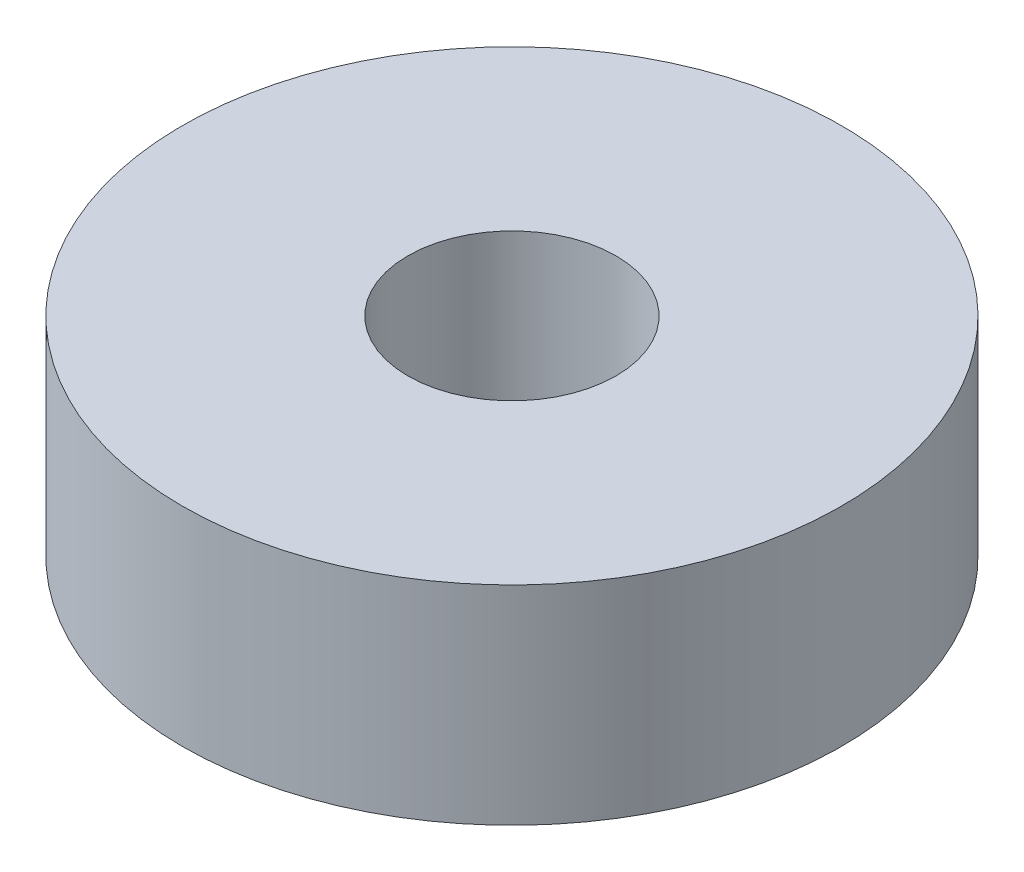
ISO-10303-21;
HEADER;
FILE_DESCRIPTION(('STEP AP214'),'2;1');
FILE_NAME('part.step','',(''),(''),'','','');
FILE_SCHEMA(('AUTOMOTIVE_DESIGN { 1 0 10303 214 1 1 1 1 }'));
ENDSEC;
DATA;
#1=APPLICATION_CONTEXT('core data for automotive mechanical design processes');
#2=APPLICATION_PROTOCOL_DEFINITION('international standard','automotive_design',2000,#1);
#3=PRODUCT_CONTEXT('',#1,'mechanical');
#4=PRODUCT('Part','Part','',(#3));
#5=PRODUCT_RELATED_PRODUCT_CATEGORY('part','',(#4));
#6=PRODUCT_DEFINITION_FORMATION('','',#4);
#7=PRODUCT_DEFINITION_CONTEXT('part definition',#1,'design');
#8=PRODUCT_DEFINITION('design','',#6,#7);
#9=PRODUCT_DEFINITION_SHAPE('','',#8);
#10=(LENGTH_UNIT() NAMED_UNIT(*) SI_UNIT(.MILLI.,.METRE.));
#11=(NAMED_UNIT(*) PLANE_ANGLE_UNIT() SI_UNIT($,.RADIAN.));
#12=(NAMED_UNIT(*) SI_UNIT($,.STERADIAN.) SOLID_ANGLE_UNIT());
#13=UNCERTAINTY_MEASURE_WITH_UNIT(LENGTH_MEASURE(1.E-05),#10,'distance_accuracy_value','');
#14=(GEOMETRIC_REPRESENTATION_CONTEXT(3) GLOBAL_UNCERTAINTY_ASSIGNED_CONTEXT((#13)) GLOBAL_UNIT_ASSIGNED_CONTEXT((#10,
#11,#12)) REPRESENTATION_CONTEXT('',''));
#15=CARTESIAN_POINT('',(0.,0.,0.));
#16=DIRECTION('',(0.,0.,1.));
#17=DIRECTION('',(1.,0.,0.));
#18=AXIS2_PLACEMENT_3D('',#15,#16,#17);
#19=CARTESIAN_POINT('',(0.,6.,0.));
#20=DIRECTION('',(0.,1.,0.));
#21=DIRECTION('',(0.,0.,1.));
#22=AXIS2_PLACEMENT_3D('',#19,#20,#21);
#23=PLANE('',#22);
#24=CARTESIAN_POINT('',(0.,6.,0.));
#25=DIRECTION('',(0.,1.,0.));
#26=DIRECTION('',(0.,0.,1.));
#27=AXIS2_PLACEMENT_3D('',#24,#25,#26);
#28=CIRCLE('',#27,9.5);
#29=CARTESIAN_POINT('',(0.,6.,9.5));
#30=VERTEX_POINT('',#29);
#31=EDGE_CURVE('E10',#30,#30,#28,.T.);
#32=ORIENTED_EDGE('',*,*,#31,.T.);
#33=EDGE_LOOP('',(#32));
#34=FACE_BOUND('',#33,.T.);
#35=CARTESIAN_POINT('',(0.,6.,0.));
#36=DIRECTION('',(0.,1.,0.));
#37=DIRECTION('',(0.,0.,1.));
#38=AXIS2_PLACEMENT_3D('',#35,#36,#37);
#39=CIRCLE('',#38,3.);
#40=CARTESIAN_POINT('',(0.,6.,3.));
#41=VERTEX_POINT('',#40);
#42=EDGE_CURVE('E45',#41,#41,#39,.T.);
#43=ORIENTED_EDGE('',*,*,#42,.F.);
#44=EDGE_LOOP('',(#43));
#45=FACE_BOUND('',#44,.T.);
#46=ADVANCED_FACE('F34',(#34,#45),#23,.T.);
#47=CARTESIAN_POINT('',(0.,0.,0.));
#48=DIRECTION('',(0.,1.,0.));
#49=DIRECTION('',(0.,0.,1.));
#50=AXIS2_PLACEMENT_3D('',#47,#48,#49);
#51=PLANE('',#50);
#52=CARTESIAN_POINT('',(0.,0.,0.));
#53=DIRECTION('',(0.,1.,0.));
#54=DIRECTION('',(0.,0.,1.));
#55=AXIS2_PLACEMENT_3D('',#52,#53,#54);
#56=CIRCLE('',#55,9.5);
#57=CARTESIAN_POINT('',(0.,0.,9.5));
#58=VERTEX_POINT('',#57);
#59=EDGE_CURVE('E38',#58,#58,#56,.T.);
#60=ORIENTED_EDGE('',*,*,#59,.F.);
#61=EDGE_LOOP('',(#60));
#62=FACE_BOUND('',#61,.T.);
#63=CARTESIAN_POINT('',(0.,0.,0.));
#64=DIRECTION('',(0.,1.,0.));
#65=DIRECTION('',(0.,0.,1.));
#66=AXIS2_PLACEMENT_3D('',#63,#64,#65);
#67=CIRCLE('',#66,3.);
#68=CARTESIAN_POINT('',(0.,0.,3.));
#69=VERTEX_POINT('',#68);
#70=EDGE_CURVE('E47',#69,#69,#67,.T.);
#71=ORIENTED_EDGE('',*,*,#70,.T.);
#72=EDGE_LOOP('',(#71));
#73=FACE_BOUND('',#72,.T.);
#74=ADVANCED_FACE('F57',(#62,#73),#51,.F.);
#75=CARTESIAN_POINT('',(0.,6.,0.));
#76=DIRECTION('',(0.,-1.,0.));
#77=DIRECTION('',(0.,0.,-1.));
#78=AXIS2_PLACEMENT_3D('',#75,#76,#77);
#79=CYLINDRICAL_SURFACE('',#78,9.5);
#80=ORIENTED_EDGE('',*,*,#31,.F.);
#81=EDGE_LOOP('',(#80));
#82=FACE_BOUND('',#81,.T.);
#83=ORIENTED_EDGE('',*,*,#59,.T.);
#84=EDGE_LOOP('',(#83));
#85=FACE_BOUND('',#84,.T.);
#86=ADVANCED_FACE('F36',(#82,#85),#79,.T.);
#87=CARTESIAN_POINT('',(0.,6.,0.));
#88=DIRECTION('',(0.,-1.,0.));
#89=DIRECTION('',(0.,0.,-1.));
#90=AXIS2_PLACEMENT_3D('',#87,#88,#89);
#91=CYLINDRICAL_SURFACE('',#90,3.);
#92=ORIENTED_EDGE('',*,*,#42,.T.);
#93=EDGE_LOOP('',(#92));
#94=FACE_BOUND('',#93,.T.);
#95=ORIENTED_EDGE('',*,*,#70,.F.);
#96=EDGE_LOOP('',(#95));
#97=FACE_BOUND('',#96,.T.);
#98=ADVANCED_FACE('F53',(#94,#97),#91,.F.);
#99=CLOSED_SHELL('',(#46,#74,#86,#98));
#100=MANIFOLD_SOLID_BREP('B2',#99);
#101=ADVANCED_BREP_SHAPE_REPRESENTATION('',(#18,#100),#14);
#102=SHAPE_DEFINITION_REPRESENTATION(#9,#101);
ENDSEC;
END-ISO-10303-21;
